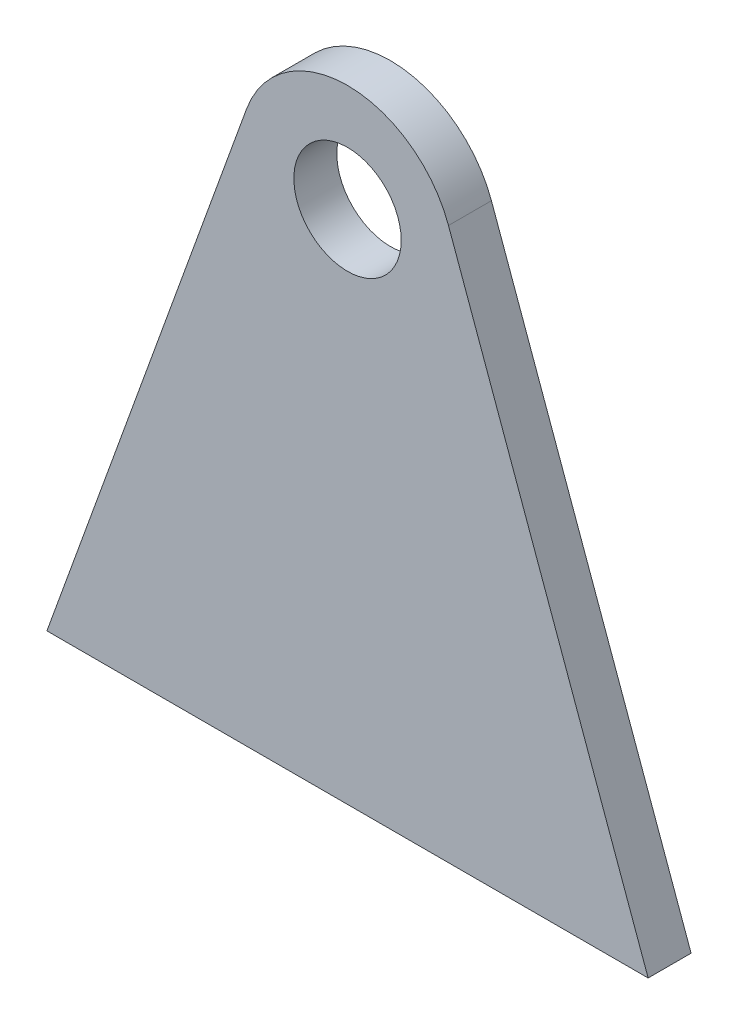
ISO-10303-21;
HEADER;
FILE_DESCRIPTION(('STEP AP214'),'2;1');
FILE_NAME('part.step','',(''),(''),'','','');
FILE_SCHEMA(('AUTOMOTIVE_DESIGN { 1 0 10303 214 1 1 1 1 }'));
ENDSEC;
DATA;
#1=APPLICATION_CONTEXT('core data for automotive mechanical design processes');
#2=APPLICATION_PROTOCOL_DEFINITION('international standard','automotive_design',2000,#1);
#3=PRODUCT_CONTEXT('',#1,'mechanical');
#4=PRODUCT('Part','Part','',(#3));
#5=PRODUCT_RELATED_PRODUCT_CATEGORY('part','',(#4));
#6=PRODUCT_DEFINITION_FORMATION('','',#4);
#7=PRODUCT_DEFINITION_CONTEXT('part definition',#1,'design');
#8=PRODUCT_DEFINITION('design','',#6,#7);
#9=PRODUCT_DEFINITION_SHAPE('','',#8);
#10=(LENGTH_UNIT() NAMED_UNIT(*) SI_UNIT(.MILLI.,.METRE.));
#11=(NAMED_UNIT(*) PLANE_ANGLE_UNIT() SI_UNIT($,.RADIAN.));
#12=(NAMED_UNIT(*) SI_UNIT($,.STERADIAN.) SOLID_ANGLE_UNIT());
#13=UNCERTAINTY_MEASURE_WITH_UNIT(LENGTH_MEASURE(1.E-05),#10,'distance_accuracy_value','');
#14=(GEOMETRIC_REPRESENTATION_CONTEXT(3) GLOBAL_UNCERTAINTY_ASSIGNED_CONTEXT((#13)) GLOBAL_UNIT_ASSIGNED_CONTEXT((#10,
#11,#12)) REPRESENTATION_CONTEXT('',''));
#15=CARTESIAN_POINT('',(0.,0.,0.));
#16=DIRECTION('',(0.,0.,1.));
#17=DIRECTION('',(1.,0.,0.));
#18=AXIS2_PLACEMENT_3D('',#15,#16,#17);
#19=CARTESIAN_POINT('',(140.,240.,20.));
#20=DIRECTION('',(0.,0.,1.));
#21=DIRECTION('',(1.,0.,0.));
#22=AXIS2_PLACEMENT_3D('',#19,#20,#21);
#23=PLANE('',#22);
#24=DIRECTION('',(-0.340204935652928,-0.940351318262163,0.));
#25=VECTOR('',#24,1.);
#26=CARTESIAN_POINT('',(0.,0.,20.));
#27=LINE('',#26,#25);
#28=CARTESIAN_POINT('',(92.9824340868919,257.010246782646,20.));
#29=VERTEX_POINT('',#28);
#30=CARTESIAN_POINT('',(0.,0.,20.));
#31=VERTEX_POINT('',#30);
#32=EDGE_CURVE('E85',#29,#31,#27,.T.);
#33=ORIENTED_EDGE('',*,*,#32,.T.);
#34=DIRECTION('',(1.,0.,0.));
#35=VECTOR('',#34,1.);
#36=CARTESIAN_POINT('',(0.,0.,20.));
#37=LINE('',#36,#35);
#38=CARTESIAN_POINT('',(280.,0.,20.));
#39=VERTEX_POINT('',#38);
#40=EDGE_CURVE('E80',#31,#39,#37,.T.);
#41=ORIENTED_EDGE('',*,*,#40,.T.);
#42=DIRECTION('',(-0.340204935652928,0.940351318262163,0.));
#43=VECTOR('',#42,1.);
#44=CARTESIAN_POINT('',(280.,0.,20.));
#45=LINE('',#44,#43);
#46=CARTESIAN_POINT('',(187.017565913108,257.010246782646,20.));
#47=VERTEX_POINT('',#46);
#48=EDGE_CURVE('E83',#39,#47,#45,.T.);
#49=ORIENTED_EDGE('',*,*,#48,.T.);
#50=CARTESIAN_POINT('',(140.,240.,20.));
#51=DIRECTION('',(0.,0.,1.));
#52=DIRECTION('',(1.,0.,0.));
#53=AXIS2_PLACEMENT_3D('',#50,#51,#52);
#54=CIRCLE('',#53,50.);
#55=EDGE_CURVE('E50',#47,#29,#54,.T.);
#56=ORIENTED_EDGE('',*,*,#55,.T.);
#57=EDGE_LOOP('',(#33,#41,#49,#56));
#58=FACE_BOUND('',#57,.T.);
#59=CARTESIAN_POINT('',(140.,240.,20.));
#60=DIRECTION('',(0.,0.,1.));
#61=DIRECTION('',(1.,0.,0.));
#62=AXIS2_PLACEMENT_3D('',#59,#60,#61);
#63=CIRCLE('',#62,25.);
#64=CARTESIAN_POINT('',(165.,240.,20.));
#65=VERTEX_POINT('',#64);
#66=EDGE_CURVE('E100',#65,#65,#63,.T.);
#67=ORIENTED_EDGE('',*,*,#66,.F.);
#68=EDGE_LOOP('',(#67));
#69=FACE_BOUND('',#68,.T.);
#70=ADVANCED_FACE('F33',(#58,#69),#23,.T.);
#71=CARTESIAN_POINT('',(140.,240.,0.));
#72=DIRECTION('',(0.,0.,1.));
#73=DIRECTION('',(1.,0.,0.));
#74=AXIS2_PLACEMENT_3D('',#71,#72,#73);
#75=PLANE('',#74);
#76=DIRECTION('',(-0.340204935652928,-0.940351318262163,0.));
#77=VECTOR('',#76,1.);
#78=CARTESIAN_POINT('',(0.,0.,0.));
#79=LINE('',#78,#77);
#80=CARTESIAN_POINT('',(92.9824340868919,257.010246782646,0.));
#81=VERTEX_POINT('',#80);
#82=CARTESIAN_POINT('',(0.,0.,0.));
#83=VERTEX_POINT('',#82);
#84=EDGE_CURVE('E97',#81,#83,#79,.T.);
#85=ORIENTED_EDGE('',*,*,#84,.F.);
#86=CARTESIAN_POINT('',(140.,240.,0.));
#87=DIRECTION('',(0.,0.,1.));
#88=DIRECTION('',(1.,0.,0.));
#89=AXIS2_PLACEMENT_3D('',#86,#87,#88);
#90=CIRCLE('',#89,50.);
#91=CARTESIAN_POINT('',(187.017565913108,257.010246782646,0.));
#92=VERTEX_POINT('',#91);
#93=EDGE_CURVE('E73',#92,#81,#90,.T.);
#94=ORIENTED_EDGE('',*,*,#93,.F.);
#95=DIRECTION('',(-0.340204935652928,0.940351318262163,0.));
#96=VECTOR('',#95,1.);
#97=CARTESIAN_POINT('',(280.,0.,0.));
#98=LINE('',#97,#96);
#99=CARTESIAN_POINT('',(280.,0.,0.));
#100=VERTEX_POINT('',#99);
#101=EDGE_CURVE('E67',#100,#92,#98,.T.);
#102=ORIENTED_EDGE('',*,*,#101,.F.);
#103=DIRECTION('',(1.,0.,0.));
#104=VECTOR('',#103,1.);
#105=CARTESIAN_POINT('',(0.,0.,0.));
#106=LINE('',#105,#104);
#107=EDGE_CURVE('E89',#83,#100,#106,.T.);
#108=ORIENTED_EDGE('',*,*,#107,.F.);
#109=EDGE_LOOP('',(#85,#94,#102,#108));
#110=FACE_BOUND('',#109,.T.);
#111=CARTESIAN_POINT('',(140.,240.,0.));
#112=DIRECTION('',(0.,0.,1.));
#113=DIRECTION('',(1.,0.,0.));
#114=AXIS2_PLACEMENT_3D('',#111,#112,#113);
#115=CIRCLE('',#114,25.);
#116=CARTESIAN_POINT('',(165.,240.,0.));
#117=VERTEX_POINT('',#116);
#118=EDGE_CURVE('E112',#117,#117,#115,.T.);
#119=ORIENTED_EDGE('',*,*,#118,.T.);
#120=EDGE_LOOP('',(#119));
#121=FACE_BOUND('',#120,.T.);
#122=ADVANCED_FACE('F108',(#110,#121),#75,.F.);
#123=CARTESIAN_POINT('',(0.,0.,20.));
#124=DIRECTION('',(0.940351318262163,-0.340204935652928,0.));
#125=DIRECTION('',(0.340204935652928,0.940351318262163,0.));
#126=AXIS2_PLACEMENT_3D('',#123,#124,#125);
#127=PLANE('',#126);
#128=ORIENTED_EDGE('',*,*,#84,.T.);
#129=DIRECTION('',(0.,0.,-1.));
#130=VECTOR('',#129,1.);
#131=CARTESIAN_POINT('',(0.,0.,20.));
#132=LINE('',#131,#130);
#133=EDGE_CURVE('E11',#31,#83,#132,.T.);
#134=ORIENTED_EDGE('',*,*,#133,.F.);
#135=ORIENTED_EDGE('',*,*,#32,.F.);
#136=DIRECTION('',(0.,0.,-1.));
#137=VECTOR('',#136,1.);
#138=CARTESIAN_POINT('',(92.9824340868919,257.010246782646,20.));
#139=LINE('',#138,#137);
#140=EDGE_CURVE('E93',#29,#81,#139,.T.);
#141=ORIENTED_EDGE('',*,*,#140,.T.);
#142=EDGE_LOOP('',(#128,#134,#135,#141));
#143=FACE_BOUND('',#142,.T.);
#144=ADVANCED_FACE('F35',(#143),#127,.F.);
#145=CARTESIAN_POINT('',(0.,0.,20.));
#146=DIRECTION('',(0.,1.,0.));
#147=DIRECTION('',(0.,0.,1.));
#148=AXIS2_PLACEMENT_3D('',#145,#146,#147);
#149=PLANE('',#148);
#150=ORIENTED_EDGE('',*,*,#107,.T.);
#151=DIRECTION('',(0.,0.,-1.));
#152=VECTOR('',#151,1.);
#153=CARTESIAN_POINT('',(280.,0.,20.));
#154=LINE('',#153,#152);
#155=EDGE_CURVE('E42',#39,#100,#154,.T.);
#156=ORIENTED_EDGE('',*,*,#155,.F.);
#157=ORIENTED_EDGE('',*,*,#40,.F.);
#158=ORIENTED_EDGE('',*,*,#133,.T.);
#159=EDGE_LOOP('',(#150,#156,#157,#158));
#160=FACE_BOUND('',#159,.T.);
#161=ADVANCED_FACE('F88',(#160),#149,.F.);
#162=CARTESIAN_POINT('',(280.,0.,20.));
#163=DIRECTION('',(-0.940351318262163,-0.340204935652928,0.));
#164=DIRECTION('',(0.340204935652928,-0.940351318262163,0.));
#165=AXIS2_PLACEMENT_3D('',#162,#163,#164);
#166=PLANE('',#165);
#167=ORIENTED_EDGE('',*,*,#101,.T.);
#168=DIRECTION('',(0.,0.,-1.));
#169=VECTOR('',#168,1.);
#170=CARTESIAN_POINT('',(187.017565913108,257.010246782646,20.));
#171=LINE('',#170,#169);
#172=EDGE_CURVE('E90',#47,#92,#171,.T.);
#173=ORIENTED_EDGE('',*,*,#172,.F.);
#174=ORIENTED_EDGE('',*,*,#48,.F.);
#175=ORIENTED_EDGE('',*,*,#155,.T.);
#176=EDGE_LOOP('',(#167,#173,#174,#175));
#177=FACE_BOUND('',#176,.T.);
#178=ADVANCED_FACE('F91',(#177),#166,.F.);
#179=CARTESIAN_POINT('',(140.,240.,20.));
#180=DIRECTION('',(0.,0.,-1.));
#181=DIRECTION('',(-1.,0.,0.));
#182=AXIS2_PLACEMENT_3D('',#179,#180,#181);
#183=CYLINDRICAL_SURFACE('',#182,50.);
#184=ORIENTED_EDGE('',*,*,#93,.T.);
#185=ORIENTED_EDGE('',*,*,#140,.F.);
#186=ORIENTED_EDGE('',*,*,#55,.F.);
#187=ORIENTED_EDGE('',*,*,#172,.T.);
#188=EDGE_LOOP('',(#184,#185,#186,#187));
#189=FACE_BOUND('',#188,.T.);
#190=ADVANCED_FACE('F105',(#189),#183,.T.);
#191=CARTESIAN_POINT('',(140.,240.,20.));
#192=DIRECTION('',(0.,0.,-1.));
#193=DIRECTION('',(-1.,0.,0.));
#194=AXIS2_PLACEMENT_3D('',#191,#192,#193);
#195=CYLINDRICAL_SURFACE('',#194,25.);
#196=ORIENTED_EDGE('',*,*,#66,.T.);
#197=EDGE_LOOP('',(#196));
#198=FACE_BOUND('',#197,.T.);
#199=ORIENTED_EDGE('',*,*,#118,.F.);
#200=EDGE_LOOP('',(#199));
#201=FACE_BOUND('',#200,.T.);
#202=ADVANCED_FACE('F118',(#198,#201),#195,.F.);
#203=CLOSED_SHELL('',(#70,#122,#144,#161,#178,#190,#202));
#204=MANIFOLD_SOLID_BREP('B2',#203);
#205=ADVANCED_BREP_SHAPE_REPRESENTATION('',(#18,#204),#14);
#206=SHAPE_DEFINITION_REPRESENTATION(#9,#205);
ENDSEC;
END-ISO-10303-21;
